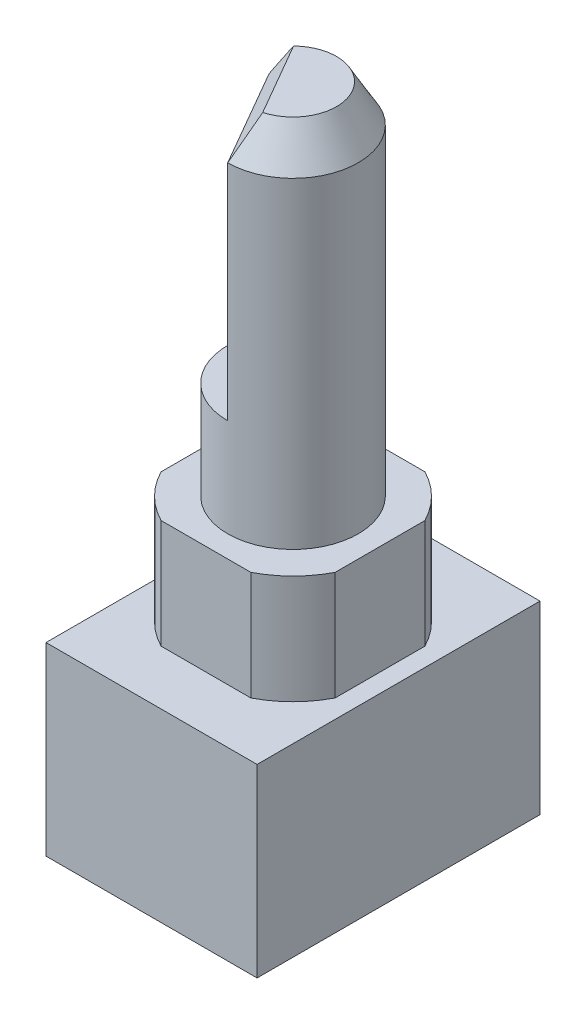
ISO-10303-21;
HEADER;
FILE_DESCRIPTION(('STEP AP214'),'2;1');
FILE_NAME('part.step','',(''),(''),'','','');
FILE_SCHEMA(('AUTOMOTIVE_DESIGN { 1 0 10303 214 1 1 1 1 }'));
ENDSEC;
DATA;
#1=APPLICATION_CONTEXT('core data for automotive mechanical design processes');
#2=APPLICATION_PROTOCOL_DEFINITION('international standard','automotive_design',2000,#1);
#3=PRODUCT_CONTEXT('',#1,'mechanical');
#4=PRODUCT('Part','Part','',(#3));
#5=PRODUCT_RELATED_PRODUCT_CATEGORY('part','',(#4));
#6=PRODUCT_DEFINITION_FORMATION('','',#4);
#7=PRODUCT_DEFINITION_CONTEXT('part definition',#1,'design');
#8=PRODUCT_DEFINITION('design','',#6,#7);
#9=PRODUCT_DEFINITION_SHAPE('','',#8);
#10=(LENGTH_UNIT() NAMED_UNIT(*) SI_UNIT(.MILLI.,.METRE.));
#11=(NAMED_UNIT(*) PLANE_ANGLE_UNIT() SI_UNIT($,.RADIAN.));
#12=(NAMED_UNIT(*) SI_UNIT($,.STERADIAN.) SOLID_ANGLE_UNIT());
#13=UNCERTAINTY_MEASURE_WITH_UNIT(LENGTH_MEASURE(1.E-05),#10,'distance_accuracy_value','');
#14=(GEOMETRIC_REPRESENTATION_CONTEXT(3) GLOBAL_UNCERTAINTY_ASSIGNED_CONTEXT((#13)) GLOBAL_UNIT_ASSIGNED_CONTEXT((#10,
#11,#12)) REPRESENTATION_CONTEXT('',''));
#15=CARTESIAN_POINT('',(0.,0.,0.));
#16=DIRECTION('',(0.,0.,1.));
#17=DIRECTION('',(1.,0.,0.));
#18=AXIS2_PLACEMENT_3D('',#15,#16,#17);
#19=CARTESIAN_POINT('',(0.,13.5,0.));
#20=DIRECTION('',(0.,-1.,0.));
#21=DIRECTION('',(0.,0.,-1.));
#22=AXIS2_PLACEMENT_3D('',#19,#20,#21);
#23=CYLINDRICAL_SURFACE('',#22,4.5);
#24=DIRECTION('',(0.,1.,0.));
#25=VECTOR('',#24,1.);
#26=CARTESIAN_POINT('',(2.06155281280883,4.34668806854096,-4.));
#27=LINE('',#26,#25);
#28=CARTESIAN_POINT('',(2.06155281280883,8.5,-4.));
#29=VERTEX_POINT('',#28);
#30=CARTESIAN_POINT('',(2.06155281280883,13.5,-4.));
#31=VERTEX_POINT('',#30);
#32=EDGE_CURVE('E174',#29,#31,#27,.T.);
#33=ORIENTED_EDGE('',*,*,#32,.T.);
#34=CARTESIAN_POINT('',(0.,13.5,0.));
#35=DIRECTION('',(0.,1.,0.));
#36=DIRECTION('',(0.,0.,1.));
#37=AXIS2_PLACEMENT_3D('',#34,#35,#36);
#38=CIRCLE('',#37,4.5);
#39=CARTESIAN_POINT('',(4.,13.5,-2.06155281280883));
#40=VERTEX_POINT('',#39);
#41=EDGE_CURVE('E336',#40,#31,#38,.T.);
#42=ORIENTED_EDGE('',*,*,#41,.F.);
#43=DIRECTION('',(0.,1.,0.));
#44=VECTOR('',#43,1.);
#45=CARTESIAN_POINT('',(4.,4.34668806854096,-2.06155281280883));
#46=LINE('',#45,#44);
#47=CARTESIAN_POINT('',(4.,8.5,-2.06155281280883));
#48=VERTEX_POINT('',#47);
#49=EDGE_CURVE('E181',#48,#40,#46,.T.);
#50=ORIENTED_EDGE('',*,*,#49,.F.);
#51=CARTESIAN_POINT('',(0.,8.5,0.));
#52=DIRECTION('',(0.,1.,0.));
#53=DIRECTION('',(0.,0.,1.));
#54=AXIS2_PLACEMENT_3D('',#51,#52,#53);
#55=CIRCLE('',#54,4.5);
#56=EDGE_CURVE('E338',#48,#29,#55,.T.);
#57=ORIENTED_EDGE('',*,*,#56,.T.);
#58=EDGE_LOOP('',(#33,#42,#50,#57));
#59=FACE_BOUND('',#58,.T.);
#60=ADVANCED_FACE('F36',(#59),#23,.T.);
#61=DIRECTION('',(0.,1.,0.));
#62=VECTOR('',#61,1.);
#63=CARTESIAN_POINT('',(-2.06155281280883,4.34668806854096,-4.));
#64=LINE('',#63,#62);
#65=CARTESIAN_POINT('',(-2.06155281280883,8.5,-4.));
#66=VERTEX_POINT('',#65);
#67=CARTESIAN_POINT('',(-2.06155281280883,13.5,-4.));
#68=VERTEX_POINT('',#67);
#69=EDGE_CURVE('E171',#66,#68,#64,.T.);
#70=ORIENTED_EDGE('',*,*,#69,.F.);
#71=CARTESIAN_POINT('',(-4.,8.5,-2.06155281280883));
#72=VERTEX_POINT('',#71);
#73=EDGE_CURVE('E217',#66,#72,#55,.T.);
#74=ORIENTED_EDGE('',*,*,#73,.T.);
#75=DIRECTION('',(0.,1.,0.));
#76=VECTOR('',#75,1.);
#77=CARTESIAN_POINT('',(-4.,4.34668806854096,-2.06155281280883));
#78=LINE('',#77,#76);
#79=CARTESIAN_POINT('',(-4.,13.5,-2.06155281280883));
#80=VERTEX_POINT('',#79);
#81=EDGE_CURVE('E200',#72,#80,#78,.T.);
#82=ORIENTED_EDGE('',*,*,#81,.T.);
#83=EDGE_CURVE('E212',#68,#80,#38,.T.);
#84=ORIENTED_EDGE('',*,*,#83,.F.);
#85=EDGE_LOOP('',(#70,#74,#82,#84));
#86=FACE_BOUND('',#85,.T.);
#87=ADVANCED_FACE('F297',(#86),#23,.T.);
#88=CARTESIAN_POINT('',(0.,13.5,0.));
#89=DIRECTION('',(0.,1.,0.));
#90=DIRECTION('',(0.,0.,1.));
#91=AXIS2_PLACEMENT_3D('',#88,#89,#90);
#92=PLANE('',#91);
#93=CARTESIAN_POINT('',(0.,13.5,0.));
#94=DIRECTION('',(0.,1.,0.));
#95=DIRECTION('',(0.,0.,1.));
#96=AXIS2_PLACEMENT_3D('',#93,#94,#95);
#97=CIRCLE('',#96,3.);
#98=CARTESIAN_POINT('',(0.,13.5,3.));
#99=VERTEX_POINT('',#98);
#100=EDGE_CURVE('E206',#99,#99,#97,.F.);
#101=ORIENTED_EDGE('',*,*,#100,.T.);
#102=EDGE_LOOP('',(#101));
#103=FACE_BOUND('',#102,.T.);
#104=ORIENTED_EDGE('',*,*,#41,.T.);
#105=DIRECTION('',(-1.,0.,0.));
#106=VECTOR('',#105,1.);
#107=CARTESIAN_POINT('',(0.,13.5,-4.));
#108=LINE('',#107,#106);
#109=EDGE_CURVE('E164',#31,#68,#108,.T.);
#110=ORIENTED_EDGE('',*,*,#109,.T.);
#111=ORIENTED_EDGE('',*,*,#83,.T.);
#112=DIRECTION('',(0.,0.,-1.));
#113=VECTOR('',#112,1.);
#114=CARTESIAN_POINT('',(-4.,13.5,0.));
#115=LINE('',#114,#113);
#116=CARTESIAN_POINT('',(-4.,13.5,2.06155281280883));
#117=VERTEX_POINT('',#116);
#118=EDGE_CURVE('E196',#117,#80,#115,.T.);
#119=ORIENTED_EDGE('',*,*,#118,.F.);
#120=CARTESIAN_POINT('',(-2.06155281280883,13.5,4.));
#121=VERTEX_POINT('',#120);
#122=EDGE_CURVE('E207',#117,#121,#38,.T.);
#123=ORIENTED_EDGE('',*,*,#122,.T.);
#124=DIRECTION('',(-1.,0.,0.));
#125=VECTOR('',#124,1.);
#126=CARTESIAN_POINT('',(0.,13.5,4.));
#127=LINE('',#126,#125);
#128=CARTESIAN_POINT('',(2.06155281280883,13.5,4.));
#129=VERTEX_POINT('',#128);
#130=EDGE_CURVE('E180',#129,#121,#127,.T.);
#131=ORIENTED_EDGE('',*,*,#130,.F.);
#132=CARTESIAN_POINT('',(4.,13.5,2.06155281280883));
#133=VERTEX_POINT('',#132);
#134=EDGE_CURVE('E211',#129,#133,#38,.T.);
#135=ORIENTED_EDGE('',*,*,#134,.T.);
#136=DIRECTION('',(0.,0.,-1.));
#137=VECTOR('',#136,1.);
#138=CARTESIAN_POINT('',(4.,13.5,0.));
#139=LINE('',#138,#137);
#140=EDGE_CURVE('E170',#133,#40,#139,.T.);
#141=ORIENTED_EDGE('',*,*,#140,.T.);
#142=EDGE_LOOP('',(#104,#110,#111,#119,#123,#131,#135,#141));
#143=FACE_BOUND('',#142,.T.);
#144=ADVANCED_FACE('F294',(#103,#143),#92,.T.);
#145=DIRECTION('',(0.,1.,0.));
#146=VECTOR('',#145,1.);
#147=CARTESIAN_POINT('',(4.,4.34668806854096,2.06155281280883));
#148=LINE('',#147,#146);
#149=CARTESIAN_POINT('',(4.,8.5,2.06155281280883));
#150=VERTEX_POINT('',#149);
#151=EDGE_CURVE('E184',#150,#133,#148,.T.);
#152=ORIENTED_EDGE('',*,*,#151,.T.);
#153=ORIENTED_EDGE('',*,*,#134,.F.);
#154=DIRECTION('',(0.,1.,0.));
#155=VECTOR('',#154,1.);
#156=CARTESIAN_POINT('',(2.06155281280883,4.34668806854096,4.));
#157=LINE('',#156,#155);
#158=CARTESIAN_POINT('',(2.06155281280883,8.5,4.));
#159=VERTEX_POINT('',#158);
#160=EDGE_CURVE('E189',#159,#129,#157,.T.);
#161=ORIENTED_EDGE('',*,*,#160,.F.);
#162=EDGE_CURVE('E216',#159,#150,#55,.T.);
#163=ORIENTED_EDGE('',*,*,#162,.T.);
#164=EDGE_LOOP('',(#152,#153,#161,#163));
#165=FACE_BOUND('',#164,.T.);
#166=ADVANCED_FACE('F269',(#165),#23,.T.);
#167=CARTESIAN_POINT('',(-4.85,8.5,6.5));
#168=DIRECTION('',(1.,0.,0.));
#169=DIRECTION('',(0.,0.,-1.));
#170=AXIS2_PLACEMENT_3D('',#167,#168,#169);
#171=PLANE('',#170);
#172=DIRECTION('',(0.,0.,1.));
#173=VECTOR('',#172,1.);
#174=CARTESIAN_POINT('',(-4.85,0.,6.5));
#175=LINE('',#174,#173);
#176=CARTESIAN_POINT('',(-4.85,0.,-6.5));
#177=VERTEX_POINT('',#176);
#178=CARTESIAN_POINT('',(-4.85,0.,6.5));
#179=VERTEX_POINT('',#178);
#180=EDGE_CURVE('E210',#177,#179,#175,.T.);
#181=ORIENTED_EDGE('',*,*,#180,.T.);
#182=DIRECTION('',(0.,-1.,0.));
#183=VECTOR('',#182,1.);
#184=CARTESIAN_POINT('',(-4.85,8.5,6.5));
#185=LINE('',#184,#183);
#186=CARTESIAN_POINT('',(-4.85,8.5,6.5));
#187=VERTEX_POINT('',#186);
#188=EDGE_CURVE('E244',#187,#179,#185,.T.);
#189=ORIENTED_EDGE('',*,*,#188,.F.);
#190=DIRECTION('',(0.,0.,1.));
#191=VECTOR('',#190,1.);
#192=CARTESIAN_POINT('',(-4.85,8.5,6.5));
#193=LINE('',#192,#191);
#194=CARTESIAN_POINT('',(-4.85,8.5,-6.5));
#195=VERTEX_POINT('',#194);
#196=EDGE_CURVE('E218',#195,#187,#193,.T.);
#197=ORIENTED_EDGE('',*,*,#196,.F.);
#198=DIRECTION('',(0.,-1.,0.));
#199=VECTOR('',#198,1.);
#200=CARTESIAN_POINT('',(-4.85,8.5,-6.5));
#201=LINE('',#200,#199);
#202=EDGE_CURVE('E228',#195,#177,#201,.T.);
#203=ORIENTED_EDGE('',*,*,#202,.T.);
#204=EDGE_LOOP('',(#181,#189,#197,#203));
#205=FACE_BOUND('',#204,.T.);
#206=ADVANCED_FACE('F264',(#205),#171,.F.);
#207=CARTESIAN_POINT('',(4.85,8.5,6.5));
#208=DIRECTION('',(0.,0.,-1.));
#209=DIRECTION('',(-1.,0.,0.));
#210=AXIS2_PLACEMENT_3D('',#207,#208,#209);
#211=PLANE('',#210);
#212=DIRECTION('',(1.,0.,0.));
#213=VECTOR('',#212,1.);
#214=CARTESIAN_POINT('',(4.85,0.,6.5));
#215=LINE('',#214,#213);
#216=CARTESIAN_POINT('',(4.85,0.,6.5));
#217=VERTEX_POINT('',#216);
#218=EDGE_CURVE('E231',#179,#217,#215,.T.);
#219=ORIENTED_EDGE('',*,*,#218,.T.);
#220=DIRECTION('',(0.,-1.,0.));
#221=VECTOR('',#220,1.);
#222=CARTESIAN_POINT('',(4.85,8.5,6.5));
#223=LINE('',#222,#221);
#224=CARTESIAN_POINT('',(4.85,8.5,6.5));
#225=VERTEX_POINT('',#224);
#226=EDGE_CURVE('E241',#225,#217,#223,.T.);
#227=ORIENTED_EDGE('',*,*,#226,.F.);
#228=DIRECTION('',(1.,0.,0.));
#229=VECTOR('',#228,1.);
#230=CARTESIAN_POINT('',(4.85,8.5,6.5));
#231=LINE('',#230,#229);
#232=EDGE_CURVE('E221',#187,#225,#231,.T.);
#233=ORIENTED_EDGE('',*,*,#232,.F.);
#234=ORIENTED_EDGE('',*,*,#188,.T.);
#235=EDGE_LOOP('',(#219,#227,#233,#234));
#236=FACE_BOUND('',#235,.T.);
#237=ADVANCED_FACE('F268',(#236),#211,.F.);
#238=CARTESIAN_POINT('',(4.85,8.5,6.5));
#239=DIRECTION('',(-1.,0.,0.));
#240=DIRECTION('',(0.,0.,1.));
#241=AXIS2_PLACEMENT_3D('',#238,#239,#240);
#242=PLANE('',#241);
#243=DIRECTION('',(0.,0.,-1.));
#244=VECTOR('',#243,1.);
#245=CARTESIAN_POINT('',(4.85,0.,6.5));
#246=LINE('',#245,#244);
#247=CARTESIAN_POINT('',(4.85,0.,-6.5));
#248=VERTEX_POINT('',#247);
#249=EDGE_CURVE('E233',#217,#248,#246,.T.);
#250=ORIENTED_EDGE('',*,*,#249,.T.);
#251=DIRECTION('',(0.,-1.,0.));
#252=VECTOR('',#251,1.);
#253=CARTESIAN_POINT('',(4.85,8.5,-6.5));
#254=LINE('',#253,#252);
#255=CARTESIAN_POINT('',(4.85,8.5,-6.5));
#256=VERTEX_POINT('',#255);
#257=EDGE_CURVE('E238',#256,#248,#254,.T.);
#258=ORIENTED_EDGE('',*,*,#257,.F.);
#259=DIRECTION('',(0.,0.,-1.));
#260=VECTOR('',#259,1.);
#261=CARTESIAN_POINT('',(4.85,8.5,6.5));
#262=LINE('',#261,#260);
#263=EDGE_CURVE('E224',#225,#256,#262,.T.);
#264=ORIENTED_EDGE('',*,*,#263,.F.);
#265=ORIENTED_EDGE('',*,*,#226,.T.);
#266=EDGE_LOOP('',(#250,#258,#264,#265));
#267=FACE_BOUND('',#266,.T.);
#268=ADVANCED_FACE('F273',(#267),#242,.F.);
#269=CARTESIAN_POINT('',(4.85,8.5,-6.5));
#270=DIRECTION('',(0.,0.,1.));
#271=DIRECTION('',(1.,0.,0.));
#272=AXIS2_PLACEMENT_3D('',#269,#270,#271);
#273=PLANE('',#272);
#274=DIRECTION('',(-1.,0.,0.));
#275=VECTOR('',#274,1.);
#276=CARTESIAN_POINT('',(4.85,0.,-6.5));
#277=LINE('',#276,#275);
#278=EDGE_CURVE('E222',#248,#177,#277,.T.);
#279=ORIENTED_EDGE('',*,*,#278,.T.);
#280=ORIENTED_EDGE('',*,*,#202,.F.);
#281=DIRECTION('',(-1.,0.,0.));
#282=VECTOR('',#281,1.);
#283=CARTESIAN_POINT('',(4.85,8.5,-6.5));
#284=LINE('',#283,#282);
#285=EDGE_CURVE('E226',#256,#195,#284,.T.);
#286=ORIENTED_EDGE('',*,*,#285,.F.);
#287=ORIENTED_EDGE('',*,*,#257,.T.);
#288=EDGE_LOOP('',(#279,#280,#286,#287));
#289=FACE_BOUND('',#288,.T.);
#290=ADVANCED_FACE('F277',(#289),#273,.F.);
#291=CARTESIAN_POINT('',(0.,8.5,0.));
#292=DIRECTION('',(0.,1.,0.));
#293=DIRECTION('',(0.,0.,1.));
#294=AXIS2_PLACEMENT_3D('',#291,#292,#293);
#295=PLANE('',#294);
#296=CARTESIAN_POINT('',(-4.,8.5,2.06155281280883));
#297=VERTEX_POINT('',#296);
#298=CARTESIAN_POINT('',(-2.06155281280883,8.5,4.));
#299=VERTEX_POINT('',#298);
#300=EDGE_CURVE('E213',#297,#299,#55,.T.);
#301=ORIENTED_EDGE('',*,*,#300,.F.);
#302=DIRECTION('',(0.,0.,1.));
#303=VECTOR('',#302,1.);
#304=CARTESIAN_POINT('',(-4.,8.5,0.));
#305=LINE('',#304,#303);
#306=EDGE_CURVE('E203',#72,#297,#305,.T.);
#307=ORIENTED_EDGE('',*,*,#306,.F.);
#308=ORIENTED_EDGE('',*,*,#73,.F.);
#309=DIRECTION('',(1.,0.,0.));
#310=VECTOR('',#309,1.);
#311=CARTESIAN_POINT('',(0.,8.5,-4.));
#312=LINE('',#311,#310);
#313=EDGE_CURVE('E167',#66,#29,#312,.T.);
#314=ORIENTED_EDGE('',*,*,#313,.T.);
#315=ORIENTED_EDGE('',*,*,#56,.F.);
#316=DIRECTION('',(0.,0.,1.));
#317=VECTOR('',#316,1.);
#318=CARTESIAN_POINT('',(4.,8.5,0.));
#319=LINE('',#318,#317);
#320=EDGE_CURVE('E178',#48,#150,#319,.T.);
#321=ORIENTED_EDGE('',*,*,#320,.T.);
#322=ORIENTED_EDGE('',*,*,#162,.F.);
#323=DIRECTION('',(1.,0.,0.));
#324=VECTOR('',#323,1.);
#325=CARTESIAN_POINT('',(0.,8.5,4.));
#326=LINE('',#325,#324);
#327=EDGE_CURVE('E193',#299,#159,#326,.T.);
#328=ORIENTED_EDGE('',*,*,#327,.F.);
#329=EDGE_LOOP('',(#301,#307,#308,#314,#315,#321,#322,#328));
#330=FACE_BOUND('',#329,.T.);
#331=ORIENTED_EDGE('',*,*,#196,.T.);
#332=ORIENTED_EDGE('',*,*,#232,.T.);
#333=ORIENTED_EDGE('',*,*,#263,.T.);
#334=ORIENTED_EDGE('',*,*,#285,.T.);
#335=EDGE_LOOP('',(#331,#332,#333,#334));
#336=FACE_BOUND('',#335,.T.);
#337=ADVANCED_FACE('F281',(#330,#336),#295,.T.);
#338=CARTESIAN_POINT('',(0.,0.,0.));
#339=DIRECTION('',(0.,1.,0.));
#340=DIRECTION('',(0.,0.,1.));
#341=AXIS2_PLACEMENT_3D('',#338,#339,#340);
#342=PLANE('',#341);
#343=ORIENTED_EDGE('',*,*,#180,.F.);
#344=ORIENTED_EDGE('',*,*,#278,.F.);
#345=ORIENTED_EDGE('',*,*,#249,.F.);
#346=ORIENTED_EDGE('',*,*,#218,.F.);
#347=EDGE_LOOP('',(#343,#344,#345,#346));
#348=FACE_BOUND('',#347,.T.);
#349=ADVANCED_FACE('F283',(#348),#342,.F.);
#350=ORIENTED_EDGE('',*,*,#300,.T.);
#351=DIRECTION('',(0.,1.,0.));
#352=VECTOR('',#351,1.);
#353=CARTESIAN_POINT('',(-2.06155281280883,4.34668806854096,4.));
#354=LINE('',#353,#352);
#355=EDGE_CURVE('E190',#299,#121,#354,.T.);
#356=ORIENTED_EDGE('',*,*,#355,.T.);
#357=ORIENTED_EDGE('',*,*,#122,.F.);
#358=DIRECTION('',(0.,1.,0.));
#359=VECTOR('',#358,1.);
#360=CARTESIAN_POINT('',(-4.,4.34668806854096,2.06155281280883));
#361=LINE('',#360,#359);
#362=EDGE_CURVE('E199',#297,#117,#361,.T.);
#363=ORIENTED_EDGE('',*,*,#362,.F.);
#364=EDGE_LOOP('',(#350,#356,#357,#363));
#365=FACE_BOUND('',#364,.T.);
#366=ADVANCED_FACE('F286',(#365),#23,.T.);
#367=CARTESIAN_POINT('',(0.,30.,0.));
#368=DIRECTION('',(0.,-1.,0.));
#369=DIRECTION('',(0.,0.,-1.));
#370=AXIS2_PLACEMENT_3D('',#367,#368,#369);
#371=CYLINDRICAL_SURFACE('',#370,3.);
#372=DIRECTION('',(0.,1.,0.));
#373=VECTOR('',#372,1.);
#374=CARTESIAN_POINT('',(-2.59807621135333,18.,-1.49999999999997));
#375=LINE('',#374,#373);
#376=CARTESIAN_POINT('',(-2.59807621135333,18.,-1.49999999999997));
#377=VERTEX_POINT('',#376);
#378=CARTESIAN_POINT('',(-2.59807621135333,28.2679491924311,-1.49999999999997));
#379=VERTEX_POINT('',#378);
#380=EDGE_CURVE('E158',#377,#379,#375,.T.);
#381=ORIENTED_EDGE('',*,*,#380,.T.);
#382=CARTESIAN_POINT('',(0.,28.2679491924311,0.));
#383=DIRECTION('',(0.,1.,0.));
#384=DIRECTION('',(0.,0.,1.));
#385=AXIS2_PLACEMENT_3D('',#382,#383,#384);
#386=CIRCLE('',#385,3.);
#387=CARTESIAN_POINT('',(0.,28.2679491924311,3.));
#388=VERTEX_POINT('',#387);
#389=EDGE_CURVE('E50',#379,#388,#386,.F.);
#390=ORIENTED_EDGE('',*,*,#389,.T.);
#391=DIRECTION('',(0.,1.,0.));
#392=VECTOR('',#391,1.);
#393=CARTESIAN_POINT('',(0.,18.,3.));
#394=LINE('',#393,#392);
#395=CARTESIAN_POINT('',(0.,18.,3.));
#396=VERTEX_POINT('',#395);
#397=EDGE_CURVE('E157',#396,#388,#394,.T.);
#398=ORIENTED_EDGE('',*,*,#397,.F.);
#399=CARTESIAN_POINT('',(0.,18.,0.));
#400=DIRECTION('',(0.,1.,0.));
#401=DIRECTION('',(0.,0.,-1.));
#402=AXIS2_PLACEMENT_3D('',#399,#400,#401);
#403=CIRCLE('',#402,3.);
#404=EDGE_CURVE('E149',#377,#396,#403,.T.);
#405=ORIENTED_EDGE('',*,*,#404,.F.);
#406=EDGE_LOOP('',(#381,#390,#398,#405));
#407=FACE_BOUND('',#406,.T.);
#408=ORIENTED_EDGE('',*,*,#100,.F.);
#409=EDGE_LOOP('',(#408));
#410=FACE_BOUND('',#409,.T.);
#411=ADVANCED_FACE('F161',(#407,#410),#371,.T.);
#412=CARTESIAN_POINT('',(0.,30.,0.));
#413=DIRECTION('',(0.,1.,0.));
#414=DIRECTION('',(0.,0.,1.));
#415=AXIS2_PLACEMENT_3D('',#412,#413,#414);
#416=PLANE('',#415);
#417=DIRECTION('',(0.50000000000001,0.,0.866025403784433));
#418=VECTOR('',#417,1.);
#419=CARTESIAN_POINT('',(0.866025403784473,30.,2.49999999999999));
#420=LINE('',#419,#418);
#421=CARTESIAN_POINT('',(-1.40125853844409,30.,-1.42705098312483));
#422=VERTEX_POINT('',#421);
#423=CARTESIAN_POINT('',(0.535233134659661,30.,1.92705098312483));
#424=VERTEX_POINT('',#423);
#425=EDGE_CURVE('E247',#422,#424,#420,.T.);
#426=ORIENTED_EDGE('',*,*,#425,.T.);
#427=CARTESIAN_POINT('',(0.,30.,0.));
#428=DIRECTION('',(0.,1.,0.));
#429=DIRECTION('',(0.,0.,1.));
#430=AXIS2_PLACEMENT_3D('',#427,#428,#429);
#431=CIRCLE('',#430,2.);
#432=EDGE_CURVE('E251',#424,#422,#431,.T.);
#433=ORIENTED_EDGE('',*,*,#432,.T.);
#434=EDGE_LOOP('',(#426,#433));
#435=FACE_BOUND('',#434,.T.);
#436=ADVANCED_FACE('F301',(#435),#416,.T.);
#437=CARTESIAN_POINT('',(-4.,4.34668806854096,0.));
#438=DIRECTION('',(1.,0.,0.));
#439=DIRECTION('',(0.,0.,-1.));
#440=AXIS2_PLACEMENT_3D('',#437,#438,#439);
#441=PLANE('',#440);
#442=ORIENTED_EDGE('',*,*,#306,.T.);
#443=ORIENTED_EDGE('',*,*,#362,.T.);
#444=ORIENTED_EDGE('',*,*,#118,.T.);
#445=ORIENTED_EDGE('',*,*,#81,.F.);
#446=EDGE_LOOP('',(#442,#443,#444,#445));
#447=FACE_BOUND('',#446,.T.);
#448=ADVANCED_FACE('F304',(#447),#441,.F.);
#449=CARTESIAN_POINT('',(0.,4.34668806854096,4.));
#450=DIRECTION('',(0.,0.,-1.));
#451=DIRECTION('',(-1.,0.,0.));
#452=AXIS2_PLACEMENT_3D('',#449,#450,#451);
#453=PLANE('',#452);
#454=ORIENTED_EDGE('',*,*,#327,.T.);
#455=ORIENTED_EDGE('',*,*,#160,.T.);
#456=ORIENTED_EDGE('',*,*,#130,.T.);
#457=ORIENTED_EDGE('',*,*,#355,.F.);
#458=EDGE_LOOP('',(#454,#455,#456,#457));
#459=FACE_BOUND('',#458,.T.);
#460=ADVANCED_FACE('F308',(#459),#453,.F.);
#461=CARTESIAN_POINT('',(4.,4.34668806854096,0.));
#462=DIRECTION('',(1.,0.,0.));
#463=DIRECTION('',(0.,0.,-1.));
#464=AXIS2_PLACEMENT_3D('',#461,#462,#463);
#465=PLANE('',#464);
#466=ORIENTED_EDGE('',*,*,#49,.T.);
#467=ORIENTED_EDGE('',*,*,#140,.F.);
#468=ORIENTED_EDGE('',*,*,#151,.F.);
#469=ORIENTED_EDGE('',*,*,#320,.F.);
#470=EDGE_LOOP('',(#466,#467,#468,#469));
#471=FACE_BOUND('',#470,.T.);
#472=ADVANCED_FACE('F312',(#471),#465,.T.);
#473=CARTESIAN_POINT('',(0.,4.34668806854096,-4.));
#474=DIRECTION('',(0.,0.,-1.));
#475=DIRECTION('',(-1.,0.,0.));
#476=AXIS2_PLACEMENT_3D('',#473,#474,#475);
#477=PLANE('',#476);
#478=ORIENTED_EDGE('',*,*,#69,.T.);
#479=ORIENTED_EDGE('',*,*,#109,.F.);
#480=ORIENTED_EDGE('',*,*,#32,.F.);
#481=ORIENTED_EDGE('',*,*,#313,.F.);
#482=EDGE_LOOP('',(#478,#479,#480,#481));
#483=FACE_BOUND('',#482,.T.);
#484=ADVANCED_FACE('F316',(#483),#477,.T.);
#485=CARTESIAN_POINT('',(0.,18.,3.));
#486=DIRECTION('',(0.866025403784433,0.,-0.50000000000001));
#487=DIRECTION('',(-0.50000000000001,0.,-0.866025403784433));
#488=AXIS2_PLACEMENT_3D('',#485,#486,#487);
#489=PLANE('',#488);
#490=ORIENTED_EDGE('',*,*,#397,.T.);
#491=DIRECTION('',(-0.50000000000001,0.,-0.866025403784433));
#492=VECTOR('',#491,1.);
#493=CARTESIAN_POINT('',(-2.59807621135333,28.2679491924311,-1.49999999999997));
#494=LINE('',#493,#492);
#495=EDGE_CURVE('E11',#388,#379,#494,.T.);
#496=ORIENTED_EDGE('',*,*,#495,.T.);
#497=ORIENTED_EDGE('',*,*,#380,.F.);
#498=DIRECTION('',(-0.50000000000001,0.,-0.866025403784433));
#499=VECTOR('',#498,1.);
#500=CARTESIAN_POINT('',(0.,18.,3.));
#501=LINE('',#500,#499);
#502=EDGE_CURVE('E152',#396,#377,#501,.T.);
#503=ORIENTED_EDGE('',*,*,#502,.F.);
#504=EDGE_LOOP('',(#490,#496,#497,#503));
#505=FACE_BOUND('',#504,.T.);
#506=ADVANCED_FACE('F156',(#505),#489,.F.);
#507=CARTESIAN_POINT('',(0.,18.,0.));
#508=DIRECTION('',(0.,-1.,0.));
#509=DIRECTION('',(0.,0.,-1.));
#510=AXIS2_PLACEMENT_3D('',#507,#508,#509);
#511=PLANE('',#510);
#512=ORIENTED_EDGE('',*,*,#404,.T.);
#513=ORIENTED_EDGE('',*,*,#502,.T.);
#514=EDGE_LOOP('',(#512,#513));
#515=FACE_BOUND('',#514,.T.);
#516=ADVANCED_FACE('F151',(#515),#511,.F.);
#517=CARTESIAN_POINT('',(0.,28.2679491924311,3.));
#518=DIRECTION('',(-0.749999999999995,0.5,0.433012701892228));
#519=DIRECTION('',(0.50000000000001,0.,0.866025403784433));
#520=AXIS2_PLACEMENT_3D('',#517,#518,#519);
#521=PLANE('',#520);
#522=CARTESIAN_POINT('',(-1.40125853844409,30.,-1.42705098312483));
#523=CARTESIAN_POINT('',(-1.45258694559633,29.9290624512391,-1.43404276643853));
#524=CARTESIAN_POINT('',(-1.50369127192509,29.8579031094729,-1.44039032587838));
#525=CARTESIAN_POINT('',(-1.60548710725003,29.715201061013,-1.45192775247564));
#526=CARTESIAN_POINT('',(-1.65617863581964,29.6436583727661,-1.4571176748358));
#527=CARTESIAN_POINT('',(-1.80764620657956,29.4286037738656,-1.47114354195958));
#528=CARTESIAN_POINT('',(-1.90786408298292,29.2845976096743,-1.47844200039534));
#529=CARTESIAN_POINT('',(-2.10701386279586,28.9956298864066,-1.48970835171598));
#530=CARTESIAN_POINT('',(-2.2059460626541,28.8506685596185,-1.49367702628866));
#531=CARTESIAN_POINT('',(-2.40276498031886,28.559886926879,-1.49881168369967));
#532=CARTESIAN_POINT('',(-2.50065118423529,28.4140662488109,-1.49997634677082));
#533=CARTESIAN_POINT('',(-2.59807621135333,28.2679491924311,-1.49999999999997));
#534=B_SPLINE_CURVE_WITH_KNOTS('',3,(#522,#523,#524,#525,#526,#527,#528,#529,#530,#531,#532,
#533),.UNSPECIFIED.,.F.,.F.,(4,2,2,2,2,4),(0.,0.263508107300021,0.527003646344579,
1.05374357361828,1.58035981073958,2.10722386248991),.UNSPECIFIED.);
#535=EDGE_CURVE('E254',#379,#422,#534,.F.);
#536=ORIENTED_EDGE('',*,*,#535,.F.);
#537=ORIENTED_EDGE('',*,*,#495,.F.);
#538=CARTESIAN_POINT('',(0.,28.2679491924311,3.));
#539=CARTESIAN_POINT('',(0.0486920292617336,28.4140662488109,2.91561562493681));
#540=CARTESIAN_POINT('',(0.0966265034134803,28.559886926879,2.83026135412958));
#541=CARTESIAN_POINT('',(0.190589218488191,28.8506685596185,2.65724384278103));
#542=CARTESIAN_POINT('',(0.236618345418014,28.9956298864066,2.56958170716518));
#543=CARTESIAN_POINT('',(0.326436288872846,29.2845976096743,2.39147976302878));
#544=CARTESIAN_POINT('',(0.370224576660694,29.4286037738656,2.30103930693225));
#545=CARTESIAN_POINT('',(0.433811604801344,29.6436583727661,2.16285160924276));
#546=CARTESIAN_POINT('',(0.454662764478587,29.715201061013,2.11635649656473));
#547=CARTESIAN_POINT('',(0.495568977613523,29.8579031094729,2.02243000387524));
#548=CARTESIAN_POINT('',(0.515623993050966,29.9290624512391,1.97499857931132));
#549=CARTESIAN_POINT('',(0.53523313465966,30.,1.92705098312483));
#550=B_SPLINE_CURVE_WITH_KNOTS('',3,(#538,#539,#540,#541,#542,#543,#544,#545,#546,#547,#548,
#549),.UNSPECIFIED.,.F.,.F.,(4,2,2,2,2,4),(0.,0.526864051750331,1.05348028887163,
1.58022021614533,1.84371575518989,2.10722386248991),.UNSPECIFIED.);
#551=EDGE_CURVE('E41',#424,#388,#550,.F.);
#552=ORIENTED_EDGE('',*,*,#551,.F.);
#553=ORIENTED_EDGE('',*,*,#425,.F.);
#554=EDGE_LOOP('',(#536,#537,#552,#553));
#555=FACE_BOUND('',#554,.T.);
#556=ADVANCED_FACE('F259',(#555),#521,.T.);
#557=CARTESIAN_POINT('',(0.,30.,0.));
#558=DIRECTION('',(0.,-1.,0.));
#559=DIRECTION('',(0.,0.,-1.));
#560=AXIS2_PLACEMENT_3D('',#557,#558,#559);
#561=CONICAL_SURFACE('',#560,2.,0.5235987755983);
#562=ORIENTED_EDGE('',*,*,#551,.T.);
#563=ORIENTED_EDGE('',*,*,#389,.F.);
#564=ORIENTED_EDGE('',*,*,#535,.T.);
#565=ORIENTED_EDGE('',*,*,#432,.F.);
#566=EDGE_LOOP('',(#562,#563,#564,#565));
#567=FACE_BOUND('',#566,.T.);
#568=ADVANCED_FACE('F38',(#567),#561,.T.);
#569=CLOSED_SHELL('',(#60,#87,#144,#166,#206,#237,#268,#290,#337,#349,#366,#411,#436,#448,#460,
#472,#484,#506,#516,#556,#568));
#570=MANIFOLD_SOLID_BREP('B2',#569);
#571=ADVANCED_BREP_SHAPE_REPRESENTATION('',(#18,#570),#14);
#572=SHAPE_DEFINITION_REPRESENTATION(#9,#571);
ENDSEC;
END-ISO-10303-21;
